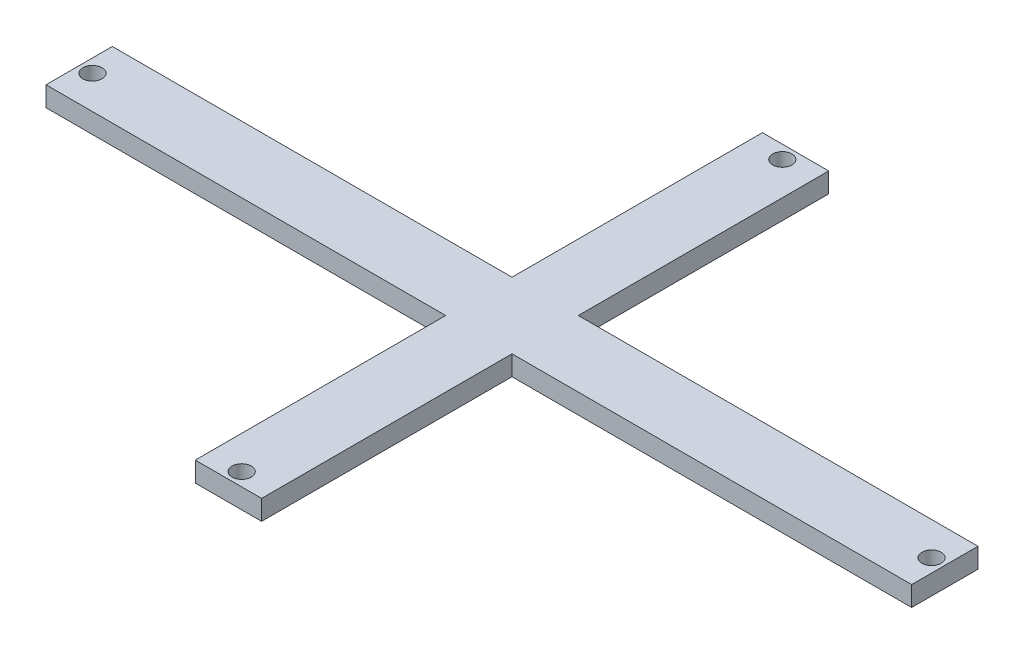
ISO-10303-21;
HEADER;
FILE_DESCRIPTION(('STEP AP214'),'2;1');
FILE_NAME('part.step','',(''),(''),'','','');
FILE_SCHEMA(('AUTOMOTIVE_DESIGN { 1 0 10303 214 1 1 1 1 }'));
ENDSEC;
DATA;
#1=APPLICATION_CONTEXT('core data for automotive mechanical design processes');
#2=APPLICATION_PROTOCOL_DEFINITION('international standard','automotive_design',2000,#1);
#3=PRODUCT_CONTEXT('',#1,'mechanical');
#4=PRODUCT('Part','Part','',(#3));
#5=PRODUCT_RELATED_PRODUCT_CATEGORY('part','',(#4));
#6=PRODUCT_DEFINITION_FORMATION('','',#4);
#7=PRODUCT_DEFINITION_CONTEXT('part definition',#1,'design');
#8=PRODUCT_DEFINITION('design','',#6,#7);
#9=PRODUCT_DEFINITION_SHAPE('','',#8);
#10=(LENGTH_UNIT() NAMED_UNIT(*) SI_UNIT(.MILLI.,.METRE.));
#11=(NAMED_UNIT(*) PLANE_ANGLE_UNIT() SI_UNIT($,.RADIAN.));
#12=(NAMED_UNIT(*) SI_UNIT($,.STERADIAN.) SOLID_ANGLE_UNIT());
#13=UNCERTAINTY_MEASURE_WITH_UNIT(LENGTH_MEASURE(1.E-05),#10,'distance_accuracy_value','');
#14=(GEOMETRIC_REPRESENTATION_CONTEXT(3) GLOBAL_UNCERTAINTY_ASSIGNED_CONTEXT((#13)) GLOBAL_UNIT_ASSIGNED_CONTEXT((#10,
#11,#12)) REPRESENTATION_CONTEXT('',''));
#15=CARTESIAN_POINT('',(0.,0.,0.));
#16=DIRECTION('',(0.,0.,1.));
#17=DIRECTION('',(1.,0.,0.));
#18=AXIS2_PLACEMENT_3D('',#15,#16,#17);
#19=CARTESIAN_POINT('',(0.,3.,-7.64705882352941));
#20=DIRECTION('',(0.,0.,-1.));
#21=DIRECTION('',(-1.,0.,0.));
#22=AXIS2_PLACEMENT_3D('',#19,#20,#21);
#23=PLANE('',#22);
#24=DIRECTION('',(1.,0.,0.));
#25=VECTOR('',#24,1.);
#26=CARTESIAN_POINT('',(0.,0.,-7.64705882352941));
#27=LINE('',#26,#25);
#28=CARTESIAN_POINT('',(-25.0425825634757,0.,-7.64705882352941));
#29=VERTEX_POINT('',#28);
#30=CARTESIAN_POINT('',(35.2074174365243,0.,-7.64705882352941));
#31=VERTEX_POINT('',#30);
#32=EDGE_CURVE('E278',#29,#31,#27,.T.);
#33=ORIENTED_EDGE('',*,*,#32,.F.);
#34=DIRECTION('',(0.,-1.,0.));
#35=VECTOR('',#34,1.);
#36=CARTESIAN_POINT('',(-25.0425825634757,3.,-7.64705882352941));
#37=LINE('',#36,#35);
#38=CARTESIAN_POINT('',(-25.0425825634757,3.,-7.64705882352941));
#39=VERTEX_POINT('',#38);
#40=EDGE_CURVE('E268',#39,#29,#37,.T.);
#41=ORIENTED_EDGE('',*,*,#40,.F.);
#42=DIRECTION('',(1.,0.,0.));
#43=VECTOR('',#42,1.);
#44=CARTESIAN_POINT('',(0.,3.,-7.64705882352941));
#45=LINE('',#44,#43);
#46=CARTESIAN_POINT('',(35.2074174365243,3.,-7.64705882352941));
#47=VERTEX_POINT('',#46);
#48=EDGE_CURVE('E281',#39,#47,#45,.T.);
#49=ORIENTED_EDGE('',*,*,#48,.T.);
#50=DIRECTION('',(0.,-1.,0.));
#51=VECTOR('',#50,1.);
#52=CARTESIAN_POINT('',(35.2074174365243,3.,-7.64705882352941));
#53=LINE('',#52,#51);
#54=EDGE_CURVE('E148',#47,#31,#53,.T.);
#55=ORIENTED_EDGE('',*,*,#54,.T.);
#56=EDGE_LOOP('',(#33,#41,#49,#55));
#57=FACE_BOUND('',#56,.T.);
#58=ADVANCED_FACE('F69',(#57),#23,.T.);
#59=CARTESIAN_POINT('',(0.,3.,2.35294117647059));
#60=DIRECTION('',(0.,0.,-1.));
#61=DIRECTION('',(-1.,0.,0.));
#62=AXIS2_PLACEMENT_3D('',#59,#60,#61);
#63=PLANE('',#62);
#64=DIRECTION('',(1.,0.,0.));
#65=VECTOR('',#64,1.);
#66=CARTESIAN_POINT('',(0.,0.,2.35294117647059));
#67=LINE('',#66,#65);
#68=CARTESIAN_POINT('',(-25.0425825634757,0.,2.35294117647059));
#69=VERTEX_POINT('',#68);
#70=CARTESIAN_POINT('',(35.2074174365243,0.,2.35294117647059));
#71=VERTEX_POINT('',#70);
#72=EDGE_CURVE('E249',#69,#71,#67,.T.);
#73=ORIENTED_EDGE('',*,*,#72,.T.);
#74=DIRECTION('',(0.,-1.,0.));
#75=VECTOR('',#74,1.);
#76=CARTESIAN_POINT('',(35.2074174365243,3.,2.35294117647059));
#77=LINE('',#76,#75);
#78=CARTESIAN_POINT('',(35.2074174365243,3.,2.35294117647059));
#79=VERTEX_POINT('',#78);
#80=EDGE_CURVE('E242',#79,#71,#77,.T.);
#81=ORIENTED_EDGE('',*,*,#80,.F.);
#82=DIRECTION('',(1.,0.,0.));
#83=VECTOR('',#82,1.);
#84=CARTESIAN_POINT('',(0.,3.,2.35294117647059));
#85=LINE('',#84,#83);
#86=CARTESIAN_POINT('',(-25.0425825634757,3.,2.35294117647059));
#87=VERTEX_POINT('',#86);
#88=EDGE_CURVE('E333',#87,#79,#85,.T.);
#89=ORIENTED_EDGE('',*,*,#88,.F.);
#90=DIRECTION('',(0.,-1.,0.));
#91=VECTOR('',#90,1.);
#92=CARTESIAN_POINT('',(-25.0425825634757,3.,2.35294117647059));
#93=LINE('',#92,#91);
#94=EDGE_CURVE('E265',#87,#69,#93,.T.);
#95=ORIENTED_EDGE('',*,*,#94,.T.);
#96=EDGE_LOOP('',(#73,#81,#89,#95));
#97=FACE_BOUND('',#96,.T.);
#98=ADVANCED_FACE('F174',(#97),#63,.F.);
#99=CARTESIAN_POINT('',(-25.0425825634757,3.,0.));
#100=DIRECTION('',(1.,0.,0.));
#101=DIRECTION('',(0.,0.,-1.));
#102=AXIS2_PLACEMENT_3D('',#99,#100,#101);
#103=PLANE('',#102);
#104=DIRECTION('',(0.,0.,1.));
#105=VECTOR('',#104,1.);
#106=CARTESIAN_POINT('',(-25.0425825634757,0.,0.));
#107=LINE('',#106,#105);
#108=EDGE_CURVE('E292',#29,#69,#107,.T.);
#109=ORIENTED_EDGE('',*,*,#108,.T.);
#110=ORIENTED_EDGE('',*,*,#94,.F.);
#111=DIRECTION('',(0.,0.,1.));
#112=VECTOR('',#111,1.);
#113=CARTESIAN_POINT('',(-25.0425825634757,3.,0.));
#114=LINE('',#113,#112);
#115=EDGE_CURVE('E331',#39,#87,#114,.T.);
#116=ORIENTED_EDGE('',*,*,#115,.F.);
#117=ORIENTED_EDGE('',*,*,#40,.T.);
#118=EDGE_LOOP('',(#109,#110,#116,#117));
#119=FACE_BOUND('',#118,.T.);
#120=ADVANCED_FACE('F164',(#119),#103,.F.);
#121=CARTESIAN_POINT('',(0.,3.,-45.3970588235294));
#122=DIRECTION('',(0.,0.,-1.));
#123=DIRECTION('',(-1.,0.,0.));
#124=AXIS2_PLACEMENT_3D('',#121,#122,#123);
#125=PLANE('',#124);
#126=DIRECTION('',(1.,0.,0.));
#127=VECTOR('',#126,1.);
#128=CARTESIAN_POINT('',(0.,0.,-45.3970588235294));
#129=LINE('',#128,#127);
#130=CARTESIAN_POINT('',(35.2074174365243,0.,-45.3970588235294));
#131=VERTEX_POINT('',#130);
#132=CARTESIAN_POINT('',(45.2074174365243,0.,-45.3970588235294));
#133=VERTEX_POINT('',#132);
#134=EDGE_CURVE('E288',#131,#133,#129,.T.);
#135=ORIENTED_EDGE('',*,*,#134,.F.);
#136=DIRECTION('',(0.,-1.,0.));
#137=VECTOR('',#136,1.);
#138=CARTESIAN_POINT('',(35.2074174365243,3.,-45.3970588235294));
#139=LINE('',#138,#137);
#140=CARTESIAN_POINT('',(35.2074174365243,3.,-45.3970588235294));
#141=VERTEX_POINT('',#140);
#142=EDGE_CURVE('E141',#141,#131,#139,.T.);
#143=ORIENTED_EDGE('',*,*,#142,.F.);
#144=DIRECTION('',(1.,0.,0.));
#145=VECTOR('',#144,1.);
#146=CARTESIAN_POINT('',(0.,3.,-45.3970588235294));
#147=LINE('',#146,#145);
#148=CARTESIAN_POINT('',(45.2074174365243,3.,-45.3970588235294));
#149=VERTEX_POINT('',#148);
#150=EDGE_CURVE('E324',#141,#149,#147,.T.);
#151=ORIENTED_EDGE('',*,*,#150,.T.);
#152=DIRECTION('',(0.,-1.,0.));
#153=VECTOR('',#152,1.);
#154=CARTESIAN_POINT('',(45.2074174365243,3.,-45.3970588235294));
#155=LINE('',#154,#153);
#156=EDGE_CURVE('E138',#149,#133,#155,.T.);
#157=ORIENTED_EDGE('',*,*,#156,.T.);
#158=EDGE_LOOP('',(#135,#143,#151,#157));
#159=FACE_BOUND('',#158,.T.);
#160=ADVANCED_FACE('F173',(#159),#125,.T.);
#161=CARTESIAN_POINT('',(35.2074174365243,3.,0.));
#162=DIRECTION('',(1.,0.,0.));
#163=DIRECTION('',(0.,0.,-1.));
#164=AXIS2_PLACEMENT_3D('',#161,#162,#163);
#165=PLANE('',#164);
#166=DIRECTION('',(0.,0.,1.));
#167=VECTOR('',#166,1.);
#168=CARTESIAN_POINT('',(35.2074174365243,0.,0.));
#169=LINE('',#168,#167);
#170=EDGE_CURVE('E286',#131,#31,#169,.T.);
#171=ORIENTED_EDGE('',*,*,#170,.T.);
#172=ORIENTED_EDGE('',*,*,#54,.F.);
#173=DIRECTION('',(0.,0.,1.));
#174=VECTOR('',#173,1.);
#175=CARTESIAN_POINT('',(35.2074174365243,3.,0.));
#176=LINE('',#175,#174);
#177=EDGE_CURVE('E325',#141,#47,#176,.T.);
#178=ORIENTED_EDGE('',*,*,#177,.F.);
#179=ORIENTED_EDGE('',*,*,#142,.T.);
#180=EDGE_LOOP('',(#171,#172,#178,#179));
#181=FACE_BOUND('',#180,.T.);
#182=ADVANCED_FACE('F189',(#181),#165,.F.);
#183=CARTESIAN_POINT('',(45.2074174365243,3.,0.));
#184=DIRECTION('',(1.,0.,0.));
#185=DIRECTION('',(0.,0.,-1.));
#186=AXIS2_PLACEMENT_3D('',#183,#184,#185);
#187=PLANE('',#186);
#188=DIRECTION('',(0.,1.,0.));
#189=VECTOR('',#188,1.);
#190=CARTESIAN_POINT('',(45.2074174365243,3.,-7.64705882352941));
#191=LINE('',#190,#189);
#192=CARTESIAN_POINT('',(45.2074174365243,0.,-7.64705882352941));
#193=VERTEX_POINT('',#192);
#194=CARTESIAN_POINT('',(45.2074174365243,3.,-7.64705882352941));
#195=VERTEX_POINT('',#194);
#196=EDGE_CURVE('E78',#193,#195,#191,.T.);
#197=ORIENTED_EDGE('',*,*,#196,.F.);
#198=DIRECTION('',(0.,0.,1.));
#199=VECTOR('',#198,1.);
#200=CARTESIAN_POINT('',(45.2074174365243,0.,0.));
#201=LINE('',#200,#199);
#202=EDGE_CURVE('E117',#133,#193,#201,.T.);
#203=ORIENTED_EDGE('',*,*,#202,.F.);
#204=ORIENTED_EDGE('',*,*,#156,.F.);
#205=DIRECTION('',(0.,0.,1.));
#206=VECTOR('',#205,1.);
#207=CARTESIAN_POINT('',(45.2074174365243,3.,0.));
#208=LINE('',#207,#206);
#209=EDGE_CURVE('E259',#149,#195,#208,.T.);
#210=ORIENTED_EDGE('',*,*,#209,.T.);
#211=EDGE_LOOP('',(#197,#203,#204,#210));
#212=FACE_BOUND('',#211,.T.);
#213=ADVANCED_FACE('F171',(#212),#187,.T.);
#214=CARTESIAN_POINT('',(0.,0.,0.));
#215=DIRECTION('',(0.,1.,0.));
#216=DIRECTION('',(0.,0.,1.));
#217=AXIS2_PLACEMENT_3D('',#214,#215,#216);
#218=PLANE('',#217);
#219=CARTESIAN_POINT('',(40.2074174365243,0.,38.1029411764706));
#220=DIRECTION('',(0.,1.,0.));
#221=DIRECTION('',(0.,0.,1.));
#222=AXIS2_PLACEMENT_3D('',#219,#220,#221);
#223=CIRCLE('',#222,1.44999999999999);
#224=CARTESIAN_POINT('',(40.2074174365243,0.,39.5529411764706));
#225=VERTEX_POINT('',#224);
#226=EDGE_CURVE('E356',#225,#225,#223,.T.);
#227=ORIENTED_EDGE('',*,*,#226,.T.);
#228=EDGE_LOOP('',(#227));
#229=FACE_BOUND('',#228,.T.);
#230=CARTESIAN_POINT('',(103.457417436524,0.,-2.64705882352941));
#231=DIRECTION('',(0.,1.,0.));
#232=DIRECTION('',(0.,0.,1.));
#233=AXIS2_PLACEMENT_3D('',#230,#231,#232);
#234=CIRCLE('',#233,1.44999999999999);
#235=CARTESIAN_POINT('',(103.457417436524,0.,-1.19705882352942));
#236=VERTEX_POINT('',#235);
#237=EDGE_CURVE('E350',#236,#236,#234,.T.);
#238=ORIENTED_EDGE('',*,*,#237,.T.);
#239=EDGE_LOOP('',(#238));
#240=FACE_BOUND('',#239,.T.);
#241=CARTESIAN_POINT('',(40.2074174365243,0.,-43.3970588235294));
#242=DIRECTION('',(0.,1.,0.));
#243=DIRECTION('',(0.,0.,1.));
#244=AXIS2_PLACEMENT_3D('',#241,#242,#243);
#245=CIRCLE('',#244,1.44999999999999);
#246=CARTESIAN_POINT('',(40.2074174365243,0.,-41.9470588235294));
#247=VERTEX_POINT('',#246);
#248=EDGE_CURVE('E344',#247,#247,#245,.T.);
#249=ORIENTED_EDGE('',*,*,#248,.T.);
#250=EDGE_LOOP('',(#249));
#251=FACE_BOUND('',#250,.T.);
#252=CARTESIAN_POINT('',(-23.0425825634757,0.,-2.64705882352941));
#253=DIRECTION('',(0.,1.,0.));
#254=DIRECTION('',(0.,0.,1.));
#255=AXIS2_PLACEMENT_3D('',#252,#253,#254);
#256=CIRCLE('',#255,1.45);
#257=CARTESIAN_POINT('',(-23.0425825634757,0.,-1.19705882352941));
#258=VERTEX_POINT('',#257);
#259=EDGE_CURVE('E133',#258,#258,#256,.T.);
#260=ORIENTED_EDGE('',*,*,#259,.T.);
#261=EDGE_LOOP('',(#260));
#262=FACE_BOUND('',#261,.T.);
#263=ORIENTED_EDGE('',*,*,#202,.T.);
#264=DIRECTION('',(1.,0.,0.));
#265=VECTOR('',#264,1.);
#266=CARTESIAN_POINT('',(-25.0425825634757,0.,-7.64705882352941));
#267=LINE('',#266,#265);
#268=CARTESIAN_POINT('',(105.457417436524,0.,-7.64705882352941));
#269=VERTEX_POINT('',#268);
#270=EDGE_CURVE('E109',#193,#269,#267,.T.);
#271=ORIENTED_EDGE('',*,*,#270,.T.);
#272=DIRECTION('',(0.,0.,1.));
#273=VECTOR('',#272,1.);
#274=CARTESIAN_POINT('',(105.457417436524,0.,-7.64705882352941));
#275=LINE('',#274,#273);
#276=CARTESIAN_POINT('',(105.457417436524,0.,2.35294117647059));
#277=VERTEX_POINT('',#276);
#278=EDGE_CURVE('E113',#269,#277,#275,.T.);
#279=ORIENTED_EDGE('',*,*,#278,.T.);
#280=DIRECTION('',(1.,0.,0.));
#281=VECTOR('',#280,1.);
#282=CARTESIAN_POINT('',(-25.0425825634757,0.,2.35294117647059));
#283=LINE('',#282,#281);
#284=CARTESIAN_POINT('',(45.2074174365243,0.,2.35294117647059));
#285=VERTEX_POINT('',#284);
#286=EDGE_CURVE('E102',#285,#277,#283,.T.);
#287=ORIENTED_EDGE('',*,*,#286,.F.);
#288=CARTESIAN_POINT('',(45.2074174365243,0.,40.1029411764706));
#289=VERTEX_POINT('',#288);
#290=EDGE_CURVE('E137',#285,#289,#201,.T.);
#291=ORIENTED_EDGE('',*,*,#290,.T.);
#292=DIRECTION('',(1.,0.,0.));
#293=VECTOR('',#292,1.);
#294=CARTESIAN_POINT('',(0.,0.,40.1029411764706));
#295=LINE('',#294,#293);
#296=CARTESIAN_POINT('',(35.2074174365243,0.,40.1029411764706));
#297=VERTEX_POINT('',#296);
#298=EDGE_CURVE('E248',#297,#289,#295,.T.);
#299=ORIENTED_EDGE('',*,*,#298,.F.);
#300=DIRECTION('',(0.,0.,1.));
#301=VECTOR('',#300,1.);
#302=CARTESIAN_POINT('',(35.2074174365243,0.,0.));
#303=LINE('',#302,#301);
#304=EDGE_CURVE('E234',#71,#297,#303,.T.);
#305=ORIENTED_EDGE('',*,*,#304,.F.);
#306=ORIENTED_EDGE('',*,*,#72,.F.);
#307=ORIENTED_EDGE('',*,*,#108,.F.);
#308=ORIENTED_EDGE('',*,*,#32,.T.);
#309=ORIENTED_EDGE('',*,*,#170,.F.);
#310=ORIENTED_EDGE('',*,*,#134,.T.);
#311=EDGE_LOOP('',(#263,#271,#279,#287,#291,#299,#305,#306,#307,#308,#309,#310));
#312=FACE_BOUND('',#311,.T.);
#313=ADVANCED_FACE('F111',(#229,#240,#251,#262,#312),#218,.F.);
#314=CARTESIAN_POINT('',(0.,3.,0.));
#315=DIRECTION('',(0.,1.,0.));
#316=DIRECTION('',(0.,0.,1.));
#317=AXIS2_PLACEMENT_3D('',#314,#315,#316);
#318=PLANE('',#317);
#319=CARTESIAN_POINT('',(40.2074174365243,3.,38.1029411764706));
#320=DIRECTION('',(0.,1.,0.));
#321=DIRECTION('',(0.,0.,1.));
#322=AXIS2_PLACEMENT_3D('',#319,#320,#321);
#323=CIRCLE('',#322,1.44999999999999);
#324=CARTESIAN_POINT('',(40.2074174365243,3.,39.5529411764706));
#325=VERTEX_POINT('',#324);
#326=EDGE_CURVE('E359',#325,#325,#323,.T.);
#327=ORIENTED_EDGE('',*,*,#326,.F.);
#328=EDGE_LOOP('',(#327));
#329=FACE_BOUND('',#328,.T.);
#330=CARTESIAN_POINT('',(103.457417436524,3.,-2.64705882352941));
#331=DIRECTION('',(0.,1.,0.));
#332=DIRECTION('',(0.,0.,1.));
#333=AXIS2_PLACEMENT_3D('',#330,#331,#332);
#334=CIRCLE('',#333,1.44999999999999);
#335=CARTESIAN_POINT('',(103.457417436524,3.,-1.19705882352942));
#336=VERTEX_POINT('',#335);
#337=EDGE_CURVE('E353',#336,#336,#334,.T.);
#338=ORIENTED_EDGE('',*,*,#337,.F.);
#339=EDGE_LOOP('',(#338));
#340=FACE_BOUND('',#339,.T.);
#341=CARTESIAN_POINT('',(40.2074174365243,3.,-43.3970588235294));
#342=DIRECTION('',(0.,1.,0.));
#343=DIRECTION('',(0.,0.,1.));
#344=AXIS2_PLACEMENT_3D('',#341,#342,#343);
#345=CIRCLE('',#344,1.44999999999999);
#346=CARTESIAN_POINT('',(40.2074174365243,3.,-41.9470588235294));
#347=VERTEX_POINT('',#346);
#348=EDGE_CURVE('E347',#347,#347,#345,.T.);
#349=ORIENTED_EDGE('',*,*,#348,.F.);
#350=EDGE_LOOP('',(#349));
#351=FACE_BOUND('',#350,.T.);
#352=CARTESIAN_POINT('',(-23.0425825634757,3.,-2.64705882352941));
#353=DIRECTION('',(0.,1.,0.));
#354=DIRECTION('',(0.,0.,1.));
#355=AXIS2_PLACEMENT_3D('',#352,#353,#354);
#356=CIRCLE('',#355,1.45);
#357=CARTESIAN_POINT('',(-23.0425825634757,3.,-1.19705882352941));
#358=VERTEX_POINT('',#357);
#359=EDGE_CURVE('E341',#358,#358,#356,.T.);
#360=ORIENTED_EDGE('',*,*,#359,.F.);
#361=EDGE_LOOP('',(#360));
#362=FACE_BOUND('',#361,.T.);
#363=ORIENTED_EDGE('',*,*,#177,.T.);
#364=ORIENTED_EDGE('',*,*,#48,.F.);
#365=ORIENTED_EDGE('',*,*,#115,.T.);
#366=ORIENTED_EDGE('',*,*,#88,.T.);
#367=DIRECTION('',(0.,0.,1.));
#368=VECTOR('',#367,1.);
#369=CARTESIAN_POINT('',(35.2074174365243,3.,0.));
#370=LINE('',#369,#368);
#371=CARTESIAN_POINT('',(35.2074174365243,3.,40.1029411764706));
#372=VERTEX_POINT('',#371);
#373=EDGE_CURVE('E335',#79,#372,#370,.T.);
#374=ORIENTED_EDGE('',*,*,#373,.T.);
#375=DIRECTION('',(1.,0.,0.));
#376=VECTOR('',#375,1.);
#377=CARTESIAN_POINT('',(0.,3.,40.1029411764706));
#378=LINE('',#377,#376);
#379=CARTESIAN_POINT('',(45.2074174365243,3.,40.1029411764706));
#380=VERTEX_POINT('',#379);
#381=EDGE_CURVE('E253',#372,#380,#378,.T.);
#382=ORIENTED_EDGE('',*,*,#381,.T.);
#383=CARTESIAN_POINT('',(45.2074174365243,3.,2.35294117647059));
#384=VERTEX_POINT('',#383);
#385=EDGE_CURVE('E161',#384,#380,#208,.T.);
#386=ORIENTED_EDGE('',*,*,#385,.F.);
#387=DIRECTION('',(1.,0.,0.));
#388=VECTOR('',#387,1.);
#389=CARTESIAN_POINT('',(-25.0425825634757,3.,2.35294117647059));
#390=LINE('',#389,#388);
#391=CARTESIAN_POINT('',(105.457417436524,3.,2.35294117647059));
#392=VERTEX_POINT('',#391);
#393=EDGE_CURVE('E119',#384,#392,#390,.T.);
#394=ORIENTED_EDGE('',*,*,#393,.T.);
#395=DIRECTION('',(0.,0.,1.));
#396=VECTOR('',#395,1.);
#397=CARTESIAN_POINT('',(105.457417436524,3.,-7.64705882352941));
#398=LINE('',#397,#396);
#399=CARTESIAN_POINT('',(105.457417436524,3.,-7.64705882352941));
#400=VERTEX_POINT('',#399);
#401=EDGE_CURVE('E153',#400,#392,#398,.T.);
#402=ORIENTED_EDGE('',*,*,#401,.F.);
#403=DIRECTION('',(1.,0.,0.));
#404=VECTOR('',#403,1.);
#405=CARTESIAN_POINT('',(-25.0425825634757,3.,-7.64705882352941));
#406=LINE('',#405,#404);
#407=EDGE_CURVE('E125',#195,#400,#406,.T.);
#408=ORIENTED_EDGE('',*,*,#407,.F.);
#409=ORIENTED_EDGE('',*,*,#209,.F.);
#410=ORIENTED_EDGE('',*,*,#150,.F.);
#411=EDGE_LOOP('',(#363,#364,#365,#366,#374,#382,#386,#394,#402,#408,#409,#410));
#412=FACE_BOUND('',#411,.T.);
#413=ADVANCED_FACE('F156',(#329,#340,#351,#362,#412),#318,.T.);
#414=CARTESIAN_POINT('',(35.2074174365243,3.,0.));
#415=DIRECTION('',(1.,0.,0.));
#416=DIRECTION('',(0.,0.,-1.));
#417=AXIS2_PLACEMENT_3D('',#414,#415,#416);
#418=PLANE('',#417);
#419=ORIENTED_EDGE('',*,*,#304,.T.);
#420=DIRECTION('',(0.,-1.,0.));
#421=VECTOR('',#420,1.);
#422=CARTESIAN_POINT('',(35.2074174365243,3.,40.1029411764706));
#423=LINE('',#422,#421);
#424=EDGE_CURVE('E238',#372,#297,#423,.T.);
#425=ORIENTED_EDGE('',*,*,#424,.F.);
#426=ORIENTED_EDGE('',*,*,#373,.F.);
#427=ORIENTED_EDGE('',*,*,#80,.T.);
#428=EDGE_LOOP('',(#419,#425,#426,#427));
#429=FACE_BOUND('',#428,.T.);
#430=ADVANCED_FACE('F185',(#429),#418,.F.);
#431=CARTESIAN_POINT('',(0.,3.,40.1029411764706));
#432=DIRECTION('',(0.,0.,-1.));
#433=DIRECTION('',(-1.,0.,0.));
#434=AXIS2_PLACEMENT_3D('',#431,#432,#433);
#435=PLANE('',#434);
#436=ORIENTED_EDGE('',*,*,#298,.T.);
#437=DIRECTION('',(0.,-1.,0.));
#438=VECTOR('',#437,1.);
#439=CARTESIAN_POINT('',(45.2074174365243,3.,40.1029411764706));
#440=LINE('',#439,#438);
#441=EDGE_CURVE('E254',#380,#289,#440,.T.);
#442=ORIENTED_EDGE('',*,*,#441,.F.);
#443=ORIENTED_EDGE('',*,*,#381,.F.);
#444=ORIENTED_EDGE('',*,*,#424,.T.);
#445=EDGE_LOOP('',(#436,#442,#443,#444));
#446=FACE_BOUND('',#445,.T.);
#447=ADVANCED_FACE('F169',(#446),#435,.F.);
#448=ORIENTED_EDGE('',*,*,#290,.F.);
#449=DIRECTION('',(0.,1.,0.));
#450=VECTOR('',#449,1.);
#451=CARTESIAN_POINT('',(45.2074174365243,3.,2.35294117647059));
#452=LINE('',#451,#450);
#453=EDGE_CURVE('E12',#285,#384,#452,.T.);
#454=ORIENTED_EDGE('',*,*,#453,.T.);
#455=ORIENTED_EDGE('',*,*,#385,.T.);
#456=ORIENTED_EDGE('',*,*,#441,.T.);
#457=EDGE_LOOP('',(#448,#454,#455,#456));
#458=FACE_BOUND('',#457,.T.);
#459=ADVANCED_FACE('F163',(#458),#187,.T.);
#460=CARTESIAN_POINT('',(-25.0425825634757,3.,2.35294117647059));
#461=DIRECTION('',(0.,0.,-1.));
#462=DIRECTION('',(-1.,0.,0.));
#463=AXIS2_PLACEMENT_3D('',#460,#461,#462);
#464=PLANE('',#463);
#465=ORIENTED_EDGE('',*,*,#453,.F.);
#466=ORIENTED_EDGE('',*,*,#286,.T.);
#467=DIRECTION('',(0.,-1.,0.));
#468=VECTOR('',#467,1.);
#469=CARTESIAN_POINT('',(105.457417436524,3.,2.35294117647059));
#470=LINE('',#469,#468);
#471=EDGE_CURVE('E129',#392,#277,#470,.T.);
#472=ORIENTED_EDGE('',*,*,#471,.F.);
#473=ORIENTED_EDGE('',*,*,#393,.F.);
#474=EDGE_LOOP('',(#465,#466,#472,#473));
#475=FACE_BOUND('',#474,.T.);
#476=ADVANCED_FACE('F71',(#475),#464,.F.);
#477=CARTESIAN_POINT('',(105.457417436524,3.,-7.64705882352941));
#478=DIRECTION('',(1.,0.,0.));
#479=DIRECTION('',(0.,0.,-1.));
#480=AXIS2_PLACEMENT_3D('',#477,#478,#479);
#481=PLANE('',#480);
#482=ORIENTED_EDGE('',*,*,#278,.F.);
#483=DIRECTION('',(0.,-1.,0.));
#484=VECTOR('',#483,1.);
#485=CARTESIAN_POINT('',(105.457417436524,3.,-7.64705882352941));
#486=LINE('',#485,#484);
#487=EDGE_CURVE('E122',#400,#269,#486,.T.);
#488=ORIENTED_EDGE('',*,*,#487,.F.);
#489=ORIENTED_EDGE('',*,*,#401,.T.);
#490=ORIENTED_EDGE('',*,*,#471,.T.);
#491=EDGE_LOOP('',(#482,#488,#489,#490));
#492=FACE_BOUND('',#491,.T.);
#493=ADVANCED_FACE('F131',(#492),#481,.T.);
#494=CARTESIAN_POINT('',(-25.0425825634757,3.,-7.64705882352941));
#495=DIRECTION('',(0.,0.,-1.));
#496=DIRECTION('',(-1.,0.,0.));
#497=AXIS2_PLACEMENT_3D('',#494,#495,#496);
#498=PLANE('',#497);
#499=ORIENTED_EDGE('',*,*,#270,.F.);
#500=ORIENTED_EDGE('',*,*,#196,.T.);
#501=ORIENTED_EDGE('',*,*,#407,.T.);
#502=ORIENTED_EDGE('',*,*,#487,.T.);
#503=EDGE_LOOP('',(#499,#500,#501,#502));
#504=FACE_BOUND('',#503,.T.);
#505=ADVANCED_FACE('F123',(#504),#498,.T.);
#506=CARTESIAN_POINT('',(-23.0425825634757,3.,-2.64705882352941));
#507=DIRECTION('',(0.,1.,0.));
#508=DIRECTION('',(0.,0.,1.));
#509=AXIS2_PLACEMENT_3D('',#506,#507,#508);
#510=CYLINDRICAL_SURFACE('',#509,1.45);
#511=ORIENTED_EDGE('',*,*,#259,.F.);
#512=EDGE_LOOP('',(#511));
#513=FACE_BOUND('',#512,.T.);
#514=ORIENTED_EDGE('',*,*,#359,.T.);
#515=EDGE_LOOP('',(#514));
#516=FACE_BOUND('',#515,.T.);
#517=ADVANCED_FACE('F199',(#513,#516),#510,.F.);
#518=CARTESIAN_POINT('',(40.2074174365243,3.,-43.3970588235294));
#519=DIRECTION('',(0.,1.,0.));
#520=DIRECTION('',(0.,0.,1.));
#521=AXIS2_PLACEMENT_3D('',#518,#519,#520);
#522=CYLINDRICAL_SURFACE('',#521,1.44999999999999);
#523=ORIENTED_EDGE('',*,*,#248,.F.);
#524=EDGE_LOOP('',(#523));
#525=FACE_BOUND('',#524,.T.);
#526=ORIENTED_EDGE('',*,*,#348,.T.);
#527=EDGE_LOOP('',(#526));
#528=FACE_BOUND('',#527,.T.);
#529=ADVANCED_FACE('F203',(#525,#528),#522,.F.);
#530=CARTESIAN_POINT('',(103.457417436524,3.,-2.64705882352941));
#531=DIRECTION('',(0.,1.,0.));
#532=DIRECTION('',(0.,0.,1.));
#533=AXIS2_PLACEMENT_3D('',#530,#531,#532);
#534=CYLINDRICAL_SURFACE('',#533,1.44999999999999);
#535=ORIENTED_EDGE('',*,*,#237,.F.);
#536=EDGE_LOOP('',(#535));
#537=FACE_BOUND('',#536,.T.);
#538=ORIENTED_EDGE('',*,*,#337,.T.);
#539=EDGE_LOOP('',(#538));
#540=FACE_BOUND('',#539,.T.);
#541=ADVANCED_FACE('F209',(#537,#540),#534,.F.);
#542=CARTESIAN_POINT('',(40.2074174365243,3.,38.1029411764706));
#543=DIRECTION('',(0.,1.,0.));
#544=DIRECTION('',(0.,0.,1.));
#545=AXIS2_PLACEMENT_3D('',#542,#543,#544);
#546=CYLINDRICAL_SURFACE('',#545,1.44999999999999);
#547=ORIENTED_EDGE('',*,*,#226,.F.);
#548=EDGE_LOOP('',(#547));
#549=FACE_BOUND('',#548,.T.);
#550=ORIENTED_EDGE('',*,*,#326,.T.);
#551=EDGE_LOOP('',(#550));
#552=FACE_BOUND('',#551,.T.);
#553=ADVANCED_FACE('F363',(#549,#552),#546,.F.);
#554=CLOSED_SHELL('',(#58,#98,#120,#160,#182,#213,#313,#413,#430,#447,#459,#476,#493,#505,#517,
#529,#541,#553));
#555=MANIFOLD_SOLID_BREP('B2',#554);
#556=ADVANCED_BREP_SHAPE_REPRESENTATION('',(#18,#555),#14);
#557=SHAPE_DEFINITION_REPRESENTATION(#9,#556);
ENDSEC;
END-ISO-10303-21;
